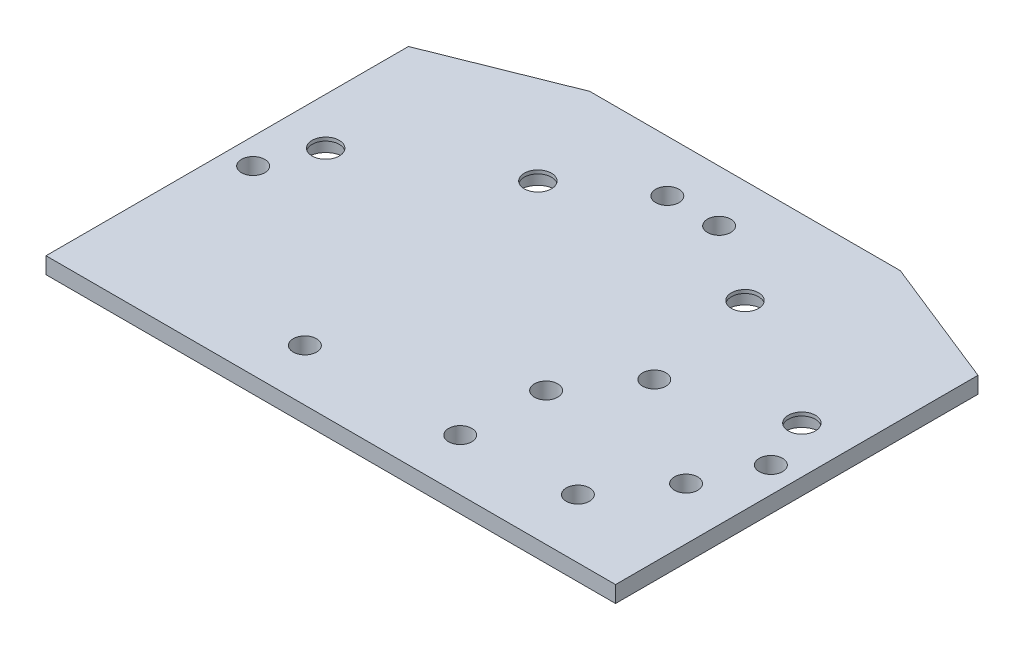
ISO-10303-21;
HEADER;
FILE_DESCRIPTION(('STEP AP214'),'2;1');
FILE_NAME('part.step','',(''),(''),'','','');
FILE_SCHEMA(('AUTOMOTIVE_DESIGN { 1 0 10303 214 1 1 1 1 }'));
ENDSEC;
DATA;
#1=APPLICATION_CONTEXT('core data for automotive mechanical design processes');
#2=APPLICATION_PROTOCOL_DEFINITION('international standard','automotive_design',2000,#1);
#3=PRODUCT_CONTEXT('',#1,'mechanical');
#4=PRODUCT('Part','Part','',(#3));
#5=PRODUCT_RELATED_PRODUCT_CATEGORY('part','',(#4));
#6=PRODUCT_DEFINITION_FORMATION('','',#4);
#7=PRODUCT_DEFINITION_CONTEXT('part definition',#1,'design');
#8=PRODUCT_DEFINITION('design','',#6,#7);
#9=PRODUCT_DEFINITION_SHAPE('','',#8);
#10=(LENGTH_UNIT() NAMED_UNIT(*) SI_UNIT(.MILLI.,.METRE.));
#11=(NAMED_UNIT(*) PLANE_ANGLE_UNIT() SI_UNIT($,.RADIAN.));
#12=(NAMED_UNIT(*) SI_UNIT($,.STERADIAN.) SOLID_ANGLE_UNIT());
#13=UNCERTAINTY_MEASURE_WITH_UNIT(LENGTH_MEASURE(1.E-05),#10,'distance_accuracy_value','');
#14=(GEOMETRIC_REPRESENTATION_CONTEXT(3) GLOBAL_UNCERTAINTY_ASSIGNED_CONTEXT((#13)) GLOBAL_UNIT_ASSIGNED_CONTEXT((#10,
#11,#12)) REPRESENTATION_CONTEXT('',''));
#15=CARTESIAN_POINT('',(0.,0.,0.));
#16=DIRECTION('',(0.,0.,1.));
#17=DIRECTION('',(1.,0.,0.));
#18=AXIS2_PLACEMENT_3D('',#15,#16,#17);
#19=CARTESIAN_POINT('',(-45.9807621135332,1.5875,9.99999999999996));
#20=DIRECTION('',(0.,1.,0.));
#21=DIRECTION('',(0.,0.,1.));
#22=AXIS2_PLACEMENT_3D('',#19,#20,#21);
#23=CYLINDRICAL_SURFACE('',#22,2.625);
#24=CARTESIAN_POINT('',(-45.9807621135332,1.5875,9.99999999999996));
#25=DIRECTION('',(0.,1.,0.));
#26=DIRECTION('',(0.,0.,1.));
#27=AXIS2_PLACEMENT_3D('',#24,#25,#26);
#28=CIRCLE('',#27,2.625);
#29=CARTESIAN_POINT('',(-45.9807621135332,1.5875,12.625));
#30=VERTEX_POINT('',#29);
#31=EDGE_CURVE('E147',#30,#30,#28,.T.);
#32=ORIENTED_EDGE('',*,*,#31,.T.);
#33=EDGE_LOOP('',(#32));
#34=FACE_BOUND('',#33,.T.);
#35=CARTESIAN_POINT('',(-45.9807621135332,0.9125,9.99999999999996));
#36=DIRECTION('',(0.,-1.,0.));
#37=DIRECTION('',(0.,0.,-1.));
#38=AXIS2_PLACEMENT_3D('',#35,#36,#37);
#39=CIRCLE('',#38,2.625);
#40=CARTESIAN_POINT('',(-45.9807621135332,0.9125,7.37499999999996));
#41=VERTEX_POINT('',#40);
#42=EDGE_CURVE('E54',#41,#41,#39,.F.);
#43=ORIENTED_EDGE('',*,*,#42,.F.);
#44=EDGE_LOOP('',(#43));
#45=FACE_BOUND('',#44,.T.);
#46=ADVANCED_FACE('F50',(#34,#45),#23,.F.);
#47=CARTESIAN_POINT('',(-20.,1.5875,-4.99999999999997));
#48=DIRECTION('',(0.,1.,0.));
#49=DIRECTION('',(0.,0.,1.));
#50=AXIS2_PLACEMENT_3D('',#47,#48,#49);
#51=CYLINDRICAL_SURFACE('',#50,2.625);
#52=CARTESIAN_POINT('',(-20.,1.5875,-4.99999999999997));
#53=DIRECTION('',(0.,1.,0.));
#54=DIRECTION('',(0.,0.,1.));
#55=AXIS2_PLACEMENT_3D('',#52,#53,#54);
#56=CIRCLE('',#55,2.625);
#57=CARTESIAN_POINT('',(-20.,1.5875,-2.37499999999997));
#58=VERTEX_POINT('',#57);
#59=EDGE_CURVE('E200',#58,#58,#56,.T.);
#60=ORIENTED_EDGE('',*,*,#59,.T.);
#61=EDGE_LOOP('',(#60));
#62=FACE_BOUND('',#61,.T.);
#63=CARTESIAN_POINT('',(-20.,0.9125,-4.99999999999997));
#64=DIRECTION('',(0.,-1.,0.));
#65=DIRECTION('',(0.,0.,-1.));
#66=AXIS2_PLACEMENT_3D('',#63,#64,#65);
#67=CIRCLE('',#66,2.625);
#68=CARTESIAN_POINT('',(-20.,0.9125,-7.62499999999997));
#69=VERTEX_POINT('',#68);
#70=EDGE_CURVE('E182',#69,#69,#67,.F.);
#71=ORIENTED_EDGE('',*,*,#70,.F.);
#72=EDGE_LOOP('',(#71));
#73=FACE_BOUND('',#72,.T.);
#74=ADVANCED_FACE('F230',(#62,#73),#51,.F.);
#75=CARTESIAN_POINT('',(45.9807621135332,1.5875,9.99999999999996));
#76=DIRECTION('',(0.,1.,0.));
#77=DIRECTION('',(0.,0.,1.));
#78=AXIS2_PLACEMENT_3D('',#75,#76,#77);
#79=CYLINDRICAL_SURFACE('',#78,2.625);
#80=CARTESIAN_POINT('',(45.9807621135332,1.5875,9.99999999999996));
#81=DIRECTION('',(0.,1.,0.));
#82=DIRECTION('',(0.,0.,1.));
#83=AXIS2_PLACEMENT_3D('',#80,#81,#82);
#84=CIRCLE('',#83,2.625);
#85=CARTESIAN_POINT('',(45.9807621135332,1.5875,12.625));
#86=VERTEX_POINT('',#85);
#87=EDGE_CURVE('E194',#86,#86,#84,.T.);
#88=ORIENTED_EDGE('',*,*,#87,.T.);
#89=EDGE_LOOP('',(#88));
#90=FACE_BOUND('',#89,.T.);
#91=CARTESIAN_POINT('',(45.9807621135332,0.9125,9.99999999999996));
#92=DIRECTION('',(0.,-1.,0.));
#93=DIRECTION('',(0.,0.,-1.));
#94=AXIS2_PLACEMENT_3D('',#91,#92,#93);
#95=CIRCLE('',#94,2.625);
#96=CARTESIAN_POINT('',(45.9807621135332,0.9125,7.37499999999996));
#97=VERTEX_POINT('',#96);
#98=EDGE_CURVE('E178',#97,#97,#95,.F.);
#99=ORIENTED_EDGE('',*,*,#98,.F.);
#100=EDGE_LOOP('',(#99));
#101=FACE_BOUND('',#100,.T.);
#102=ADVANCED_FACE('F236',(#90,#101),#79,.F.);
#103=CARTESIAN_POINT('',(20.,1.5875,-4.99999999999997));
#104=DIRECTION('',(0.,1.,0.));
#105=DIRECTION('',(0.,0.,1.));
#106=AXIS2_PLACEMENT_3D('',#103,#104,#105);
#107=CYLINDRICAL_SURFACE('',#106,2.625);
#108=CARTESIAN_POINT('',(20.,1.5875,-4.99999999999997));
#109=DIRECTION('',(0.,1.,0.));
#110=DIRECTION('',(0.,0.,1.));
#111=AXIS2_PLACEMENT_3D('',#108,#109,#110);
#112=CIRCLE('',#111,2.625);
#113=CARTESIAN_POINT('',(20.,1.5875,-2.37499999999997));
#114=VERTEX_POINT('',#113);
#115=EDGE_CURVE('E189',#114,#114,#112,.T.);
#116=ORIENTED_EDGE('',*,*,#115,.T.);
#117=EDGE_LOOP('',(#116));
#118=FACE_BOUND('',#117,.T.);
#119=CARTESIAN_POINT('',(20.,0.9125,-4.99999999999997));
#120=DIRECTION('',(0.,-1.,0.));
#121=DIRECTION('',(0.,0.,-1.));
#122=AXIS2_PLACEMENT_3D('',#119,#120,#121);
#123=CIRCLE('',#122,2.625);
#124=CARTESIAN_POINT('',(20.,0.9125,-7.62499999999997));
#125=VERTEX_POINT('',#124);
#126=EDGE_CURVE('E174',#125,#125,#123,.F.);
#127=ORIENTED_EDGE('',*,*,#126,.F.);
#128=EDGE_LOOP('',(#127));
#129=FACE_BOUND('',#128,.T.);
#130=ADVANCED_FACE('F227',(#118,#129),#107,.F.);
#131=CARTESIAN_POINT('',(-55.,1.5875,55.));
#132=DIRECTION('',(-1.,0.,0.));
#133=DIRECTION('',(0.,0.,1.));
#134=AXIS2_PLACEMENT_3D('',#131,#132,#133);
#135=PLANE('',#134);
#136=DIRECTION('',(0.,0.,-1.));
#137=VECTOR('',#136,1.);
#138=CARTESIAN_POINT('',(-55.,-1.5875,55.));
#139=LINE('',#138,#137);
#140=CARTESIAN_POINT('',(-55.,-1.5875,55.));
#141=VERTEX_POINT('',#140);
#142=CARTESIAN_POINT('',(-55.,-1.5875,-15.));
#143=VERTEX_POINT('',#142);
#144=EDGE_CURVE('E142',#141,#143,#139,.T.);
#145=ORIENTED_EDGE('',*,*,#144,.F.);
#146=DIRECTION('',(0.,-1.,0.));
#147=VECTOR('',#146,1.);
#148=CARTESIAN_POINT('',(-55.,1.5875,55.));
#149=LINE('',#148,#147);
#150=CARTESIAN_POINT('',(-55.,1.5875,55.));
#151=VERTEX_POINT('',#150);
#152=EDGE_CURVE('E11',#151,#141,#149,.T.);
#153=ORIENTED_EDGE('',*,*,#152,.F.);
#154=DIRECTION('',(0.,0.,-1.));
#155=VECTOR('',#154,1.);
#156=CARTESIAN_POINT('',(-55.,1.5875,55.));
#157=LINE('',#156,#155);
#158=CARTESIAN_POINT('',(-55.,1.5875,-15.));
#159=VERTEX_POINT('',#158);
#160=EDGE_CURVE('E163',#151,#159,#157,.T.);
#161=ORIENTED_EDGE('',*,*,#160,.T.);
#162=DIRECTION('',(0.,-1.,0.));
#163=VECTOR('',#162,1.);
#164=CARTESIAN_POINT('',(-55.,1.5875,-15.));
#165=LINE('',#164,#163);
#166=EDGE_CURVE('E102',#159,#143,#165,.T.);
#167=ORIENTED_EDGE('',*,*,#166,.T.);
#168=EDGE_LOOP('',(#145,#153,#161,#167));
#169=FACE_BOUND('',#168,.T.);
#170=ADVANCED_FACE('F52',(#169),#135,.T.);
#171=CARTESIAN_POINT('',(55.,1.5875,55.));
#172=DIRECTION('',(0.,0.,1.));
#173=DIRECTION('',(1.,0.,0.));
#174=AXIS2_PLACEMENT_3D('',#171,#172,#173);
#175=PLANE('',#174);
#176=DIRECTION('',(-1.,0.,0.));
#177=VECTOR('',#176,1.);
#178=CARTESIAN_POINT('',(55.,-1.5875,55.));
#179=LINE('',#178,#177);
#180=CARTESIAN_POINT('',(55.,-1.5875,55.));
#181=VERTEX_POINT('',#180);
#182=EDGE_CURVE('E160',#181,#141,#179,.T.);
#183=ORIENTED_EDGE('',*,*,#182,.F.);
#184=DIRECTION('',(0.,-1.,0.));
#185=VECTOR('',#184,1.);
#186=CARTESIAN_POINT('',(55.,1.5875,55.));
#187=LINE('',#186,#185);
#188=CARTESIAN_POINT('',(55.,1.5875,55.));
#189=VERTEX_POINT('',#188);
#190=EDGE_CURVE('E61',#189,#181,#187,.T.);
#191=ORIENTED_EDGE('',*,*,#190,.F.);
#192=DIRECTION('',(-1.,0.,0.));
#193=VECTOR('',#192,1.);
#194=CARTESIAN_POINT('',(55.,1.5875,55.));
#195=LINE('',#194,#193);
#196=EDGE_CURVE('E118',#189,#151,#195,.T.);
#197=ORIENTED_EDGE('',*,*,#196,.T.);
#198=ORIENTED_EDGE('',*,*,#152,.T.);
#199=EDGE_LOOP('',(#183,#191,#197,#198));
#200=FACE_BOUND('',#199,.T.);
#201=ADVANCED_FACE('F219',(#200),#175,.T.);
#202=CARTESIAN_POINT('',(55.,1.5875,55.));
#203=DIRECTION('',(-1.,0.,0.));
#204=DIRECTION('',(0.,0.,1.));
#205=AXIS2_PLACEMENT_3D('',#202,#203,#204);
#206=PLANE('',#205);
#207=DIRECTION('',(0.,0.,-1.));
#208=VECTOR('',#207,1.);
#209=CARTESIAN_POINT('',(55.,-1.5875,55.));
#210=LINE('',#209,#208);
#211=CARTESIAN_POINT('',(55.,-1.5875,-15.));
#212=VERTEX_POINT('',#211);
#213=EDGE_CURVE('E123',#181,#212,#210,.T.);
#214=ORIENTED_EDGE('',*,*,#213,.T.);
#215=DIRECTION('',(0.,-1.,0.));
#216=VECTOR('',#215,1.);
#217=CARTESIAN_POINT('',(55.,1.5875,-15.));
#218=LINE('',#217,#216);
#219=CARTESIAN_POINT('',(55.,1.5875,-15.));
#220=VERTEX_POINT('',#219);
#221=EDGE_CURVE('E121',#220,#212,#218,.T.);
#222=ORIENTED_EDGE('',*,*,#221,.F.);
#223=DIRECTION('',(0.,0.,-1.));
#224=VECTOR('',#223,1.);
#225=CARTESIAN_POINT('',(55.,1.5875,55.));
#226=LINE('',#225,#224);
#227=EDGE_CURVE('E113',#189,#220,#226,.T.);
#228=ORIENTED_EDGE('',*,*,#227,.F.);
#229=ORIENTED_EDGE('',*,*,#190,.T.);
#230=EDGE_LOOP('',(#214,#222,#228,#229));
#231=FACE_BOUND('',#230,.T.);
#232=ADVANCED_FACE('F122',(#231),#206,.F.);
#233=CARTESIAN_POINT('',(30.,1.5875,-25.));
#234=DIRECTION('',(0.371390676354104,0.,-0.928476690885259));
#235=DIRECTION('',(-0.928476690885259,0.,-0.371390676354104));
#236=AXIS2_PLACEMENT_3D('',#233,#234,#235);
#237=PLANE('',#236);
#238=DIRECTION('',(0.928476690885259,0.,0.371390676354104));
#239=VECTOR('',#238,1.);
#240=CARTESIAN_POINT('',(30.,-1.5875,-25.));
#241=LINE('',#240,#239);
#242=CARTESIAN_POINT('',(30.,-1.5875,-25.));
#243=VERTEX_POINT('',#242);
#244=EDGE_CURVE('E155',#243,#212,#241,.T.);
#245=ORIENTED_EDGE('',*,*,#244,.F.);
#246=DIRECTION('',(0.,-1.,0.));
#247=VECTOR('',#246,1.);
#248=CARTESIAN_POINT('',(30.,1.5875,-25.));
#249=LINE('',#248,#247);
#250=CARTESIAN_POINT('',(30.,1.5875,-25.));
#251=VERTEX_POINT('',#250);
#252=EDGE_CURVE('E128',#251,#243,#249,.T.);
#253=ORIENTED_EDGE('',*,*,#252,.F.);
#254=DIRECTION('',(0.928476690885259,0.,0.371390676354104));
#255=VECTOR('',#254,1.);
#256=CARTESIAN_POINT('',(30.,1.5875,-25.));
#257=LINE('',#256,#255);
#258=EDGE_CURVE('E117',#251,#220,#257,.T.);
#259=ORIENTED_EDGE('',*,*,#258,.T.);
#260=ORIENTED_EDGE('',*,*,#221,.T.);
#261=EDGE_LOOP('',(#245,#253,#259,#260));
#262=FACE_BOUND('',#261,.T.);
#263=ADVANCED_FACE('F130',(#262),#237,.T.);
#264=CARTESIAN_POINT('',(30.,1.5875,-25.));
#265=DIRECTION('',(0.,0.,1.));
#266=DIRECTION('',(1.,0.,0.));
#267=AXIS2_PLACEMENT_3D('',#264,#265,#266);
#268=PLANE('',#267);
#269=DIRECTION('',(-1.,0.,0.));
#270=VECTOR('',#269,1.);
#271=CARTESIAN_POINT('',(30.,-1.5875,-25.));
#272=LINE('',#271,#270);
#273=CARTESIAN_POINT('',(-30.,-1.5875,-25.));
#274=VERTEX_POINT('',#273);
#275=EDGE_CURVE('E151',#243,#274,#272,.T.);
#276=ORIENTED_EDGE('',*,*,#275,.T.);
#277=DIRECTION('',(0.,-1.,0.));
#278=VECTOR('',#277,1.);
#279=CARTESIAN_POINT('',(-30.,1.5875,-25.));
#280=LINE('',#279,#278);
#281=CARTESIAN_POINT('',(-30.,1.5875,-25.));
#282=VERTEX_POINT('',#281);
#283=EDGE_CURVE('E169',#282,#274,#280,.T.);
#284=ORIENTED_EDGE('',*,*,#283,.F.);
#285=DIRECTION('',(-1.,0.,0.));
#286=VECTOR('',#285,1.);
#287=CARTESIAN_POINT('',(30.,1.5875,-25.));
#288=LINE('',#287,#286);
#289=EDGE_CURVE('E133',#251,#282,#288,.T.);
#290=ORIENTED_EDGE('',*,*,#289,.F.);
#291=ORIENTED_EDGE('',*,*,#252,.T.);
#292=EDGE_LOOP('',(#276,#284,#290,#291));
#293=FACE_BOUND('',#292,.T.);
#294=ADVANCED_FACE('F666',(#293),#268,.F.);
#295=CARTESIAN_POINT('',(-55.,1.5875,-15.));
#296=DIRECTION('',(-0.371390676354103,0.,-0.92847669088526));
#297=DIRECTION('',(-0.92847669088526,0.,0.371390676354103));
#298=AXIS2_PLACEMENT_3D('',#295,#296,#297);
#299=PLANE('',#298);
#300=DIRECTION('',(0.92847669088526,0.,-0.371390676354103));
#301=VECTOR('',#300,1.);
#302=CARTESIAN_POINT('',(-55.,-1.5875,-15.));
#303=LINE('',#302,#301);
#304=EDGE_CURVE('E146',#143,#274,#303,.T.);
#305=ORIENTED_EDGE('',*,*,#304,.F.);
#306=ORIENTED_EDGE('',*,*,#166,.F.);
#307=DIRECTION('',(0.92847669088526,0.,-0.371390676354103));
#308=VECTOR('',#307,1.);
#309=CARTESIAN_POINT('',(-55.,1.5875,-15.));
#310=LINE('',#309,#308);
#311=EDGE_CURVE('E136',#159,#282,#310,.T.);
#312=ORIENTED_EDGE('',*,*,#311,.T.);
#313=ORIENTED_EDGE('',*,*,#283,.T.);
#314=EDGE_LOOP('',(#305,#306,#312,#313));
#315=FACE_BOUND('',#314,.T.);
#316=ADVANCED_FACE('F214',(#315),#299,.T.);
#317=CARTESIAN_POINT('',(0.,1.5875,0.));
#318=DIRECTION('',(0.,1.,0.));
#319=DIRECTION('',(0.,0.,1.));
#320=AXIS2_PLACEMENT_3D('',#317,#318,#319);
#321=PLANE('',#320);
#322=CARTESIAN_POINT('',(50.,1.5875,20.));
#323=DIRECTION('',(0.,1.,0.));
#324=DIRECTION('',(0.,0.,1.));
#325=AXIS2_PLACEMENT_3D('',#322,#323,#324);
#326=CIRCLE('',#325,2.24999999999999);
#327=CARTESIAN_POINT('',(50.,1.5875,22.25));
#328=VERTEX_POINT('',#327);
#329=EDGE_CURVE('E387',#328,#328,#326,.T.);
#330=ORIENTED_EDGE('',*,*,#329,.F.);
#331=EDGE_LOOP('',(#330));
#332=FACE_BOUND('',#331,.T.);
#333=CARTESIAN_POINT('',(-50.,1.5875,20.));
#334=DIRECTION('',(0.,1.,0.));
#335=DIRECTION('',(0.,0.,1.));
#336=AXIS2_PLACEMENT_3D('',#333,#334,#335);
#337=CIRCLE('',#336,2.24999999999999);
#338=CARTESIAN_POINT('',(-50.,1.5875,22.25));
#339=VERTEX_POINT('',#338);
#340=EDGE_CURVE('E381',#339,#339,#337,.T.);
#341=ORIENTED_EDGE('',*,*,#340,.F.);
#342=EDGE_LOOP('',(#341));
#343=FACE_BOUND('',#342,.T.);
#344=CARTESIAN_POINT('',(-15.,1.5875,45.));
#345=DIRECTION('',(0.,1.,0.));
#346=DIRECTION('',(0.,0.,1.));
#347=AXIS2_PLACEMENT_3D('',#344,#345,#346);
#348=CIRCLE('',#347,2.24999999999999);
#349=CARTESIAN_POINT('',(-15.,1.5875,47.25));
#350=VERTEX_POINT('',#349);
#351=EDGE_CURVE('E375',#350,#350,#348,.T.);
#352=ORIENTED_EDGE('',*,*,#351,.F.);
#353=EDGE_LOOP('',(#352));
#354=FACE_BOUND('',#353,.T.);
#355=CARTESIAN_POINT('',(15.,1.5875,45.));
#356=DIRECTION('',(0.,1.,0.));
#357=DIRECTION('',(0.,0.,1.));
#358=AXIS2_PLACEMENT_3D('',#355,#356,#357);
#359=CIRCLE('',#358,2.24999999999999);
#360=CARTESIAN_POINT('',(15.,1.5875,47.25));
#361=VERTEX_POINT('',#360);
#362=EDGE_CURVE('E369',#361,#361,#359,.T.);
#363=ORIENTED_EDGE('',*,*,#362,.F.);
#364=EDGE_LOOP('',(#363));
#365=FACE_BOUND('',#364,.T.);
#366=CARTESIAN_POINT('',(5.,1.5875,-15.));
#367=DIRECTION('',(0.,-1.,0.));
#368=DIRECTION('',(0.,0.,-1.));
#369=AXIS2_PLACEMENT_3D('',#366,#367,#368);
#370=CIRCLE('',#369,2.25);
#371=CARTESIAN_POINT('',(5.,1.5875,-17.25));
#372=VERTEX_POINT('',#371);
#373=EDGE_CURVE('E361',#372,#372,#370,.T.);
#374=ORIENTED_EDGE('',*,*,#373,.T.);
#375=EDGE_LOOP('',(#374));
#376=FACE_BOUND('',#375,.T.);
#377=CARTESIAN_POINT('',(-5.,1.5875,-15.));
#378=DIRECTION('',(0.,-1.,0.));
#379=DIRECTION('',(0.,0.,-1.));
#380=AXIS2_PLACEMENT_3D('',#377,#378,#379);
#381=CIRCLE('',#380,2.25);
#382=CARTESIAN_POINT('',(-5.,1.5875,-17.25));
#383=VERTEX_POINT('',#382);
#384=EDGE_CURVE('E355',#383,#383,#381,.T.);
#385=ORIENTED_EDGE('',*,*,#384,.T.);
#386=EDGE_LOOP('',(#385));
#387=FACE_BOUND('',#386,.T.);
#388=CARTESIAN_POINT('',(24.4402734427934,1.5875,16.9616050490339));
#389=DIRECTION('',(0.,-1.,0.));
#390=DIRECTION('',(0.,0.,-1.));
#391=AXIS2_PLACEMENT_3D('',#388,#389,#390);
#392=CIRCLE('',#391,2.25);
#393=CARTESIAN_POINT('',(24.4402734427934,1.5875,14.7116050490339));
#394=VERTEX_POINT('',#393);
#395=EDGE_CURVE('E349',#394,#394,#392,.T.);
#396=ORIENTED_EDGE('',*,*,#395,.T.);
#397=EDGE_LOOP('',(#396));
#398=FACE_BOUND('',#397,.T.);
#399=CARTESIAN_POINT('',(15.8366268975277,1.5875,29.2488857133688));
#400=DIRECTION('',(0.,-1.,0.));
#401=DIRECTION('',(0.,0.,-1.));
#402=AXIS2_PLACEMENT_3D('',#399,#400,#401);
#403=CIRCLE('',#402,2.25);
#404=CARTESIAN_POINT('',(15.8366268975277,1.5875,26.9988857133688));
#405=VERTEX_POINT('',#404);
#406=EDGE_CURVE('E343',#405,#405,#403,.T.);
#407=ORIENTED_EDGE('',*,*,#406,.T.);
#408=EDGE_LOOP('',(#407));
#409=FACE_BOUND('',#408,.T.);
#410=CARTESIAN_POINT('',(44.9190745500182,1.5875,31.3010159578101));
#411=DIRECTION('',(0.,-1.,0.));
#412=DIRECTION('',(0.,0.,-1.));
#413=AXIS2_PLACEMENT_3D('',#410,#411,#412);
#414=CIRCLE('',#413,2.25);
#415=CARTESIAN_POINT('',(44.9190745500182,1.5875,29.0510159578101));
#416=VERTEX_POINT('',#415);
#417=EDGE_CURVE('E337',#416,#416,#414,.T.);
#418=ORIENTED_EDGE('',*,*,#417,.T.);
#419=EDGE_LOOP('',(#418));
#420=FACE_BOUND('',#419,.T.);
#421=CARTESIAN_POINT('',(36.3154280047525,1.5875,43.5882966221449));
#422=DIRECTION('',(0.,-1.,0.));
#423=DIRECTION('',(0.,0.,-1.));
#424=AXIS2_PLACEMENT_3D('',#421,#422,#423);
#425=CIRCLE('',#424,2.25);
#426=CARTESIAN_POINT('',(36.3154280047525,1.5875,41.3382966221449));
#427=VERTEX_POINT('',#426);
#428=EDGE_CURVE('E317',#427,#427,#425,.T.);
#429=ORIENTED_EDGE('',*,*,#428,.T.);
#430=EDGE_LOOP('',(#429));
#431=FACE_BOUND('',#430,.T.);
#432=ORIENTED_EDGE('',*,*,#115,.F.);
#433=EDGE_LOOP('',(#432));
#434=FACE_BOUND('',#433,.T.);
#435=ORIENTED_EDGE('',*,*,#87,.F.);
#436=EDGE_LOOP('',(#435));
#437=FACE_BOUND('',#436,.T.);
#438=ORIENTED_EDGE('',*,*,#59,.F.);
#439=EDGE_LOOP('',(#438));
#440=FACE_BOUND('',#439,.T.);
#441=ORIENTED_EDGE('',*,*,#31,.F.);
#442=EDGE_LOOP('',(#441));
#443=FACE_BOUND('',#442,.T.);
#444=ORIENTED_EDGE('',*,*,#160,.F.);
#445=ORIENTED_EDGE('',*,*,#196,.F.);
#446=ORIENTED_EDGE('',*,*,#227,.T.);
#447=ORIENTED_EDGE('',*,*,#258,.F.);
#448=ORIENTED_EDGE('',*,*,#289,.T.);
#449=ORIENTED_EDGE('',*,*,#311,.F.);
#450=EDGE_LOOP('',(#444,#445,#446,#447,#448,#449));
#451=FACE_BOUND('',#450,.T.);
#452=ADVANCED_FACE('F115',(#332,#343,#354,#365,#376,#387,#398,#409,#420,#431,#434,#437,#440,
#443,#451),#321,.T.);
#453=CARTESIAN_POINT('',(0.,-1.5875,0.));
#454=DIRECTION('',(0.,1.,0.));
#455=DIRECTION('',(0.,0.,1.));
#456=AXIS2_PLACEMENT_3D('',#453,#454,#455);
#457=PLANE('',#456);
#458=CARTESIAN_POINT('',(50.,-1.5875,20.));
#459=DIRECTION('',(0.,1.,0.));
#460=DIRECTION('',(0.,0.,1.));
#461=AXIS2_PLACEMENT_3D('',#458,#459,#460);
#462=CIRCLE('',#461,2.24999999999999);
#463=CARTESIAN_POINT('',(50.,-1.5875,22.25));
#464=VERTEX_POINT('',#463);
#465=EDGE_CURVE('E257',#464,#464,#462,.T.);
#466=ORIENTED_EDGE('',*,*,#465,.T.);
#467=EDGE_LOOP('',(#466));
#468=FACE_BOUND('',#467,.T.);
#469=CARTESIAN_POINT('',(-50.,-1.5875,20.));
#470=DIRECTION('',(0.,1.,0.));
#471=DIRECTION('',(0.,0.,1.));
#472=AXIS2_PLACEMENT_3D('',#469,#470,#471);
#473=CIRCLE('',#472,2.24999999999999);
#474=CARTESIAN_POINT('',(-50.,-1.5875,22.25));
#475=VERTEX_POINT('',#474);
#476=EDGE_CURVE('E261',#475,#475,#473,.T.);
#477=ORIENTED_EDGE('',*,*,#476,.T.);
#478=EDGE_LOOP('',(#477));
#479=FACE_BOUND('',#478,.T.);
#480=CARTESIAN_POINT('',(-15.,-1.5875,45.));
#481=DIRECTION('',(0.,1.,0.));
#482=DIRECTION('',(0.,0.,1.));
#483=AXIS2_PLACEMENT_3D('',#480,#481,#482);
#484=CIRCLE('',#483,2.24999999999999);
#485=CARTESIAN_POINT('',(-15.,-1.5875,47.25));
#486=VERTEX_POINT('',#485);
#487=EDGE_CURVE('E265',#486,#486,#484,.T.);
#488=ORIENTED_EDGE('',*,*,#487,.T.);
#489=EDGE_LOOP('',(#488));
#490=FACE_BOUND('',#489,.T.);
#491=CARTESIAN_POINT('',(15.,-1.5875,45.));
#492=DIRECTION('',(0.,1.,0.));
#493=DIRECTION('',(0.,0.,1.));
#494=AXIS2_PLACEMENT_3D('',#491,#492,#493);
#495=CIRCLE('',#494,2.24999999999999);
#496=CARTESIAN_POINT('',(15.,-1.5875,47.25));
#497=VERTEX_POINT('',#496);
#498=EDGE_CURVE('E269',#497,#497,#495,.T.);
#499=ORIENTED_EDGE('',*,*,#498,.T.);
#500=EDGE_LOOP('',(#499));
#501=FACE_BOUND('',#500,.T.);
#502=CARTESIAN_POINT('',(5.,-1.5875,-15.));
#503=DIRECTION('',(0.,-1.,0.));
#504=DIRECTION('',(0.,0.,-1.));
#505=AXIS2_PLACEMENT_3D('',#502,#503,#504);
#506=CIRCLE('',#505,2.25);
#507=CARTESIAN_POINT('',(5.,-1.5875,-17.25));
#508=VERTEX_POINT('',#507);
#509=EDGE_CURVE('E273',#508,#508,#506,.T.);
#510=ORIENTED_EDGE('',*,*,#509,.F.);
#511=EDGE_LOOP('',(#510));
#512=FACE_BOUND('',#511,.T.);
#513=CARTESIAN_POINT('',(-5.,-1.5875,-15.));
#514=DIRECTION('',(0.,-1.,0.));
#515=DIRECTION('',(0.,0.,-1.));
#516=AXIS2_PLACEMENT_3D('',#513,#514,#515);
#517=CIRCLE('',#516,2.25);
#518=CARTESIAN_POINT('',(-5.,-1.5875,-17.25));
#519=VERTEX_POINT('',#518);
#520=EDGE_CURVE('E277',#519,#519,#517,.T.);
#521=ORIENTED_EDGE('',*,*,#520,.F.);
#522=EDGE_LOOP('',(#521));
#523=FACE_BOUND('',#522,.T.);
#524=CARTESIAN_POINT('',(24.4402734427934,-1.5875,16.9616050490339));
#525=DIRECTION('',(0.,-1.,0.));
#526=DIRECTION('',(0.,0.,-1.));
#527=AXIS2_PLACEMENT_3D('',#524,#525,#526);
#528=CIRCLE('',#527,2.25);
#529=CARTESIAN_POINT('',(24.4402734427934,-1.5875,14.7116050490339));
#530=VERTEX_POINT('',#529);
#531=EDGE_CURVE('E281',#530,#530,#528,.T.);
#532=ORIENTED_EDGE('',*,*,#531,.F.);
#533=EDGE_LOOP('',(#532));
#534=FACE_BOUND('',#533,.T.);
#535=CARTESIAN_POINT('',(15.8366268975277,-1.5875,29.2488857133688));
#536=DIRECTION('',(0.,-1.,0.));
#537=DIRECTION('',(0.,0.,-1.));
#538=AXIS2_PLACEMENT_3D('',#535,#536,#537);
#539=CIRCLE('',#538,2.25);
#540=CARTESIAN_POINT('',(15.8366268975277,-1.5875,26.9988857133688));
#541=VERTEX_POINT('',#540);
#542=EDGE_CURVE('E285',#541,#541,#539,.T.);
#543=ORIENTED_EDGE('',*,*,#542,.F.);
#544=EDGE_LOOP('',(#543));
#545=FACE_BOUND('',#544,.T.);
#546=CARTESIAN_POINT('',(44.9190745500182,-1.5875,31.3010159578101));
#547=DIRECTION('',(0.,-1.,0.));
#548=DIRECTION('',(0.,0.,-1.));
#549=AXIS2_PLACEMENT_3D('',#546,#547,#548);
#550=CIRCLE('',#549,2.25);
#551=CARTESIAN_POINT('',(44.9190745500182,-1.5875,29.0510159578101));
#552=VERTEX_POINT('',#551);
#553=EDGE_CURVE('E289',#552,#552,#550,.T.);
#554=ORIENTED_EDGE('',*,*,#553,.F.);
#555=EDGE_LOOP('',(#554));
#556=FACE_BOUND('',#555,.T.);
#557=CARTESIAN_POINT('',(36.3154280047525,-1.5875,43.5882966221449));
#558=DIRECTION('',(0.,-1.,0.));
#559=DIRECTION('',(0.,0.,-1.));
#560=AXIS2_PLACEMENT_3D('',#557,#558,#559);
#561=CIRCLE('',#560,2.25);
#562=CARTESIAN_POINT('',(36.3154280047525,-1.5875,41.3382966221449));
#563=VERTEX_POINT('',#562);
#564=EDGE_CURVE('E293',#563,#563,#561,.T.);
#565=ORIENTED_EDGE('',*,*,#564,.F.);
#566=EDGE_LOOP('',(#565));
#567=FACE_BOUND('',#566,.T.);
#568=CARTESIAN_POINT('',(-45.9807621135332,-1.5875,9.99999999999996));
#569=DIRECTION('',(0.,-1.,0.));
#570=DIRECTION('',(0.,0.,-1.));
#571=AXIS2_PLACEMENT_3D('',#568,#569,#570);
#572=CIRCLE('',#571,3.45);
#573=CARTESIAN_POINT('',(-45.9807621135332,-1.5875,6.54999999999996));
#574=VERTEX_POINT('',#573);
#575=EDGE_CURVE('E297',#574,#574,#572,.T.);
#576=ORIENTED_EDGE('',*,*,#575,.F.);
#577=EDGE_LOOP('',(#576));
#578=FACE_BOUND('',#577,.T.);
#579=CARTESIAN_POINT('',(-20.,-1.5875,-4.99999999999997));
#580=DIRECTION('',(0.,-1.,0.));
#581=DIRECTION('',(0.,0.,-1.));
#582=AXIS2_PLACEMENT_3D('',#579,#580,#581);
#583=CIRCLE('',#582,3.45);
#584=CARTESIAN_POINT('',(-20.,-1.5875,-8.44999999999998));
#585=VERTEX_POINT('',#584);
#586=EDGE_CURVE('E301',#585,#585,#583,.T.);
#587=ORIENTED_EDGE('',*,*,#586,.F.);
#588=EDGE_LOOP('',(#587));
#589=FACE_BOUND('',#588,.T.);
#590=CARTESIAN_POINT('',(20.,-1.5875,-4.99999999999997));
#591=DIRECTION('',(0.,-1.,0.));
#592=DIRECTION('',(0.,0.,-1.));
#593=AXIS2_PLACEMENT_3D('',#590,#591,#592);
#594=CIRCLE('',#593,3.45);
#595=CARTESIAN_POINT('',(20.,-1.5875,-8.44999999999997));
#596=VERTEX_POINT('',#595);
#597=EDGE_CURVE('E305',#596,#596,#594,.T.);
#598=ORIENTED_EDGE('',*,*,#597,.F.);
#599=EDGE_LOOP('',(#598));
#600=FACE_BOUND('',#599,.T.);
#601=CARTESIAN_POINT('',(45.9807621135332,-1.5875,9.99999999999996));
#602=DIRECTION('',(0.,-1.,0.));
#603=DIRECTION('',(0.,0.,-1.));
#604=AXIS2_PLACEMENT_3D('',#601,#602,#603);
#605=CIRCLE('',#604,3.45);
#606=CARTESIAN_POINT('',(45.9807621135332,-1.5875,6.54999999999996));
#607=VERTEX_POINT('',#606);
#608=EDGE_CURVE('E308',#607,#607,#605,.T.);
#609=ORIENTED_EDGE('',*,*,#608,.F.);
#610=EDGE_LOOP('',(#609));
#611=FACE_BOUND('',#610,.T.);
#612=ORIENTED_EDGE('',*,*,#144,.T.);
#613=ORIENTED_EDGE('',*,*,#304,.T.);
#614=ORIENTED_EDGE('',*,*,#275,.F.);
#615=ORIENTED_EDGE('',*,*,#244,.T.);
#616=ORIENTED_EDGE('',*,*,#213,.F.);
#617=ORIENTED_EDGE('',*,*,#182,.T.);
#618=EDGE_LOOP('',(#612,#613,#614,#615,#616,#617));
#619=FACE_BOUND('',#618,.T.);
#620=ADVANCED_FACE('F218',(#468,#479,#490,#501,#512,#523,#534,#545,#556,#567,#578,#589,#600,
#611,#619),#457,.F.);
#621=CARTESIAN_POINT('',(20.,0.9125,-4.99999999999997));
#622=DIRECTION('',(0.,-1.,0.));
#623=DIRECTION('',(0.,0.,-1.));
#624=AXIS2_PLACEMENT_3D('',#621,#622,#623);
#625=PLANE('',#624);
#626=CARTESIAN_POINT('',(20.,0.9125,-4.99999999999997));
#627=DIRECTION('',(0.,-1.,0.));
#628=DIRECTION('',(0.,0.,-1.));
#629=AXIS2_PLACEMENT_3D('',#626,#627,#628);
#630=CIRCLE('',#629,3.45);
#631=CARTESIAN_POINT('',(20.,0.9125,-8.44999999999997));
#632=VERTEX_POINT('',#631);
#633=EDGE_CURVE('E311',#632,#632,#630,.T.);
#634=ORIENTED_EDGE('',*,*,#633,.T.);
#635=EDGE_LOOP('',(#634));
#636=FACE_BOUND('',#635,.T.);
#637=ORIENTED_EDGE('',*,*,#126,.T.);
#638=EDGE_LOOP('',(#637));
#639=FACE_BOUND('',#638,.T.);
#640=ADVANCED_FACE('F245',(#636,#639),#625,.T.);
#641=CARTESIAN_POINT('',(20.,0.9125,-4.99999999999997));
#642=DIRECTION('',(0.,-1.,0.));
#643=DIRECTION('',(0.,0.,-1.));
#644=AXIS2_PLACEMENT_3D('',#641,#642,#643);
#645=CYLINDRICAL_SURFACE('',#644,3.45);
#646=ORIENTED_EDGE('',*,*,#633,.F.);
#647=EDGE_LOOP('',(#646));
#648=FACE_BOUND('',#647,.T.);
#649=ORIENTED_EDGE('',*,*,#597,.T.);
#650=EDGE_LOOP('',(#649));
#651=FACE_BOUND('',#650,.T.);
#652=ADVANCED_FACE('F251',(#648,#651),#645,.F.);
#653=CARTESIAN_POINT('',(45.9807621135332,0.9125,9.99999999999996));
#654=DIRECTION('',(0.,-1.,0.));
#655=DIRECTION('',(0.,0.,-1.));
#656=AXIS2_PLACEMENT_3D('',#653,#654,#655);
#657=PLANE('',#656);
#658=CARTESIAN_POINT('',(45.9807621135332,0.9125,9.99999999999996));
#659=DIRECTION('',(0.,-1.,0.));
#660=DIRECTION('',(0.,0.,-1.));
#661=AXIS2_PLACEMENT_3D('',#658,#659,#660);
#662=CIRCLE('',#661,3.45);
#663=CARTESIAN_POINT('',(45.9807621135332,0.9125,6.54999999999996));
#664=VERTEX_POINT('',#663);
#665=EDGE_CURVE('E203',#664,#664,#662,.T.);
#666=ORIENTED_EDGE('',*,*,#665,.T.);
#667=EDGE_LOOP('',(#666));
#668=FACE_BOUND('',#667,.T.);
#669=ORIENTED_EDGE('',*,*,#98,.T.);
#670=EDGE_LOOP('',(#669));
#671=FACE_BOUND('',#670,.T.);
#672=ADVANCED_FACE('F424',(#668,#671),#657,.T.);
#673=CARTESIAN_POINT('',(45.9807621135332,0.9125,9.99999999999996));
#674=DIRECTION('',(0.,-1.,0.));
#675=DIRECTION('',(0.,0.,-1.));
#676=AXIS2_PLACEMENT_3D('',#673,#674,#675);
#677=CYLINDRICAL_SURFACE('',#676,3.45);
#678=ORIENTED_EDGE('',*,*,#665,.F.);
#679=EDGE_LOOP('',(#678));
#680=FACE_BOUND('',#679,.T.);
#681=ORIENTED_EDGE('',*,*,#608,.T.);
#682=EDGE_LOOP('',(#681));
#683=FACE_BOUND('',#682,.T.);
#684=ADVANCED_FACE('F426',(#680,#683),#677,.F.);
#685=CARTESIAN_POINT('',(-20.,0.9125,-4.99999999999997));
#686=DIRECTION('',(0.,-1.,0.));
#687=DIRECTION('',(0.,0.,-1.));
#688=AXIS2_PLACEMENT_3D('',#685,#686,#687);
#689=PLANE('',#688);
#690=CARTESIAN_POINT('',(-20.,0.9125,-4.99999999999997));
#691=DIRECTION('',(0.,-1.,0.));
#692=DIRECTION('',(0.,0.,-1.));
#693=AXIS2_PLACEMENT_3D('',#690,#691,#692);
#694=CIRCLE('',#693,3.45);
#695=CARTESIAN_POINT('',(-20.,0.9125,-8.44999999999998));
#696=VERTEX_POINT('',#695);
#697=EDGE_CURVE('E321',#696,#696,#694,.T.);
#698=ORIENTED_EDGE('',*,*,#697,.T.);
#699=EDGE_LOOP('',(#698));
#700=FACE_BOUND('',#699,.T.);
#701=ORIENTED_EDGE('',*,*,#70,.T.);
#702=EDGE_LOOP('',(#701));
#703=FACE_BOUND('',#702,.T.);
#704=ADVANCED_FACE('F433',(#700,#703),#689,.T.);
#705=CARTESIAN_POINT('',(-20.,0.9125,-4.99999999999997));
#706=DIRECTION('',(0.,-1.,0.));
#707=DIRECTION('',(0.,0.,-1.));
#708=AXIS2_PLACEMENT_3D('',#705,#706,#707);
#709=CYLINDRICAL_SURFACE('',#708,3.45);
#710=ORIENTED_EDGE('',*,*,#697,.F.);
#711=EDGE_LOOP('',(#710));
#712=FACE_BOUND('',#711,.T.);
#713=ORIENTED_EDGE('',*,*,#586,.T.);
#714=EDGE_LOOP('',(#713));
#715=FACE_BOUND('',#714,.T.);
#716=ADVANCED_FACE('F513',(#712,#715),#709,.F.);
#717=CARTESIAN_POINT('',(-45.9807621135332,0.9125,9.99999999999996));
#718=DIRECTION('',(0.,-1.,0.));
#719=DIRECTION('',(0.,0.,-1.));
#720=AXIS2_PLACEMENT_3D('',#717,#718,#719);
#721=PLANE('',#720);
#722=CARTESIAN_POINT('',(-45.9807621135332,0.9125,9.99999999999996));
#723=DIRECTION('',(0.,-1.,0.));
#724=DIRECTION('',(0.,0.,-1.));
#725=AXIS2_PLACEMENT_3D('',#722,#723,#724);
#726=CIRCLE('',#725,3.45);
#727=CARTESIAN_POINT('',(-45.9807621135332,0.9125,6.54999999999996));
#728=VERTEX_POINT('',#727);
#729=EDGE_CURVE('E179',#728,#728,#726,.T.);
#730=ORIENTED_EDGE('',*,*,#729,.T.);
#731=EDGE_LOOP('',(#730));
#732=FACE_BOUND('',#731,.T.);
#733=ORIENTED_EDGE('',*,*,#42,.T.);
#734=EDGE_LOOP('',(#733));
#735=FACE_BOUND('',#734,.T.);
#736=ADVANCED_FACE('F523',(#732,#735),#721,.T.);
#737=CARTESIAN_POINT('',(-45.9807621135332,0.9125,9.99999999999996));
#738=DIRECTION('',(0.,-1.,0.));
#739=DIRECTION('',(0.,0.,-1.));
#740=AXIS2_PLACEMENT_3D('',#737,#738,#739);
#741=CYLINDRICAL_SURFACE('',#740,3.45);
#742=ORIENTED_EDGE('',*,*,#729,.F.);
#743=EDGE_LOOP('',(#742));
#744=FACE_BOUND('',#743,.T.);
#745=ORIENTED_EDGE('',*,*,#575,.T.);
#746=EDGE_LOOP('',(#745));
#747=FACE_BOUND('',#746,.T.);
#748=ADVANCED_FACE('F533',(#744,#747),#741,.F.);
#749=CARTESIAN_POINT('',(36.3154280047525,-1.5875,43.5882966221449));
#750=DIRECTION('',(0.,-1.,0.));
#751=DIRECTION('',(0.,0.,-1.));
#752=AXIS2_PLACEMENT_3D('',#749,#750,#751);
#753=CYLINDRICAL_SURFACE('',#752,2.25);
#754=ORIENTED_EDGE('',*,*,#428,.F.);
#755=EDGE_LOOP('',(#754));
#756=FACE_BOUND('',#755,.T.);
#757=ORIENTED_EDGE('',*,*,#564,.T.);
#758=EDGE_LOOP('',(#757));
#759=FACE_BOUND('',#758,.T.);
#760=ADVANCED_FACE('F543',(#756,#759),#753,.F.);
#761=CARTESIAN_POINT('',(44.9190745500182,-1.5875,31.3010159578101));
#762=DIRECTION('',(0.,-1.,0.));
#763=DIRECTION('',(0.,0.,-1.));
#764=AXIS2_PLACEMENT_3D('',#761,#762,#763);
#765=CYLINDRICAL_SURFACE('',#764,2.25);
#766=ORIENTED_EDGE('',*,*,#417,.F.);
#767=EDGE_LOOP('',(#766));
#768=FACE_BOUND('',#767,.T.);
#769=ORIENTED_EDGE('',*,*,#553,.T.);
#770=EDGE_LOOP('',(#769));
#771=FACE_BOUND('',#770,.T.);
#772=ADVANCED_FACE('F553',(#768,#771),#765,.F.);
#773=CARTESIAN_POINT('',(15.8366268975277,-1.5875,29.2488857133688));
#774=DIRECTION('',(0.,-1.,0.));
#775=DIRECTION('',(0.,0.,-1.));
#776=AXIS2_PLACEMENT_3D('',#773,#774,#775);
#777=CYLINDRICAL_SURFACE('',#776,2.25);
#778=ORIENTED_EDGE('',*,*,#406,.F.);
#779=EDGE_LOOP('',(#778));
#780=FACE_BOUND('',#779,.T.);
#781=ORIENTED_EDGE('',*,*,#542,.T.);
#782=EDGE_LOOP('',(#781));
#783=FACE_BOUND('',#782,.T.);
#784=ADVANCED_FACE('F563',(#780,#783),#777,.F.);
#785=CARTESIAN_POINT('',(24.4402734427934,-1.5875,16.9616050490339));
#786=DIRECTION('',(0.,-1.,0.));
#787=DIRECTION('',(0.,0.,-1.));
#788=AXIS2_PLACEMENT_3D('',#785,#786,#787);
#789=CYLINDRICAL_SURFACE('',#788,2.25);
#790=ORIENTED_EDGE('',*,*,#395,.F.);
#791=EDGE_LOOP('',(#790));
#792=FACE_BOUND('',#791,.T.);
#793=ORIENTED_EDGE('',*,*,#531,.T.);
#794=EDGE_LOOP('',(#793));
#795=FACE_BOUND('',#794,.T.);
#796=ADVANCED_FACE('F573',(#792,#795),#789,.F.);
#797=CARTESIAN_POINT('',(-5.,-1.5875,-15.));
#798=DIRECTION('',(0.,-1.,0.));
#799=DIRECTION('',(0.,0.,-1.));
#800=AXIS2_PLACEMENT_3D('',#797,#798,#799);
#801=CYLINDRICAL_SURFACE('',#800,2.25);
#802=ORIENTED_EDGE('',*,*,#384,.F.);
#803=EDGE_LOOP('',(#802));
#804=FACE_BOUND('',#803,.T.);
#805=ORIENTED_EDGE('',*,*,#520,.T.);
#806=EDGE_LOOP('',(#805));
#807=FACE_BOUND('',#806,.T.);
#808=ADVANCED_FACE('F583',(#804,#807),#801,.F.);
#809=CARTESIAN_POINT('',(5.,-1.5875,-15.));
#810=DIRECTION('',(0.,-1.,0.));
#811=DIRECTION('',(0.,0.,-1.));
#812=AXIS2_PLACEMENT_3D('',#809,#810,#811);
#813=CYLINDRICAL_SURFACE('',#812,2.25);
#814=ORIENTED_EDGE('',*,*,#373,.F.);
#815=EDGE_LOOP('',(#814));
#816=FACE_BOUND('',#815,.T.);
#817=ORIENTED_EDGE('',*,*,#509,.T.);
#818=EDGE_LOOP('',(#817));
#819=FACE_BOUND('',#818,.T.);
#820=ADVANCED_FACE('F593',(#816,#819),#813,.F.);
#821=CARTESIAN_POINT('',(15.,1.5875,45.));
#822=DIRECTION('',(0.,1.,0.));
#823=DIRECTION('',(0.,0.,1.));
#824=AXIS2_PLACEMENT_3D('',#821,#822,#823);
#825=CYLINDRICAL_SURFACE('',#824,2.24999999999999);
#826=ORIENTED_EDGE('',*,*,#498,.F.);
#827=EDGE_LOOP('',(#826));
#828=FACE_BOUND('',#827,.T.);
#829=ORIENTED_EDGE('',*,*,#362,.T.);
#830=EDGE_LOOP('',(#829));
#831=FACE_BOUND('',#830,.T.);
#832=ADVANCED_FACE('F603',(#828,#831),#825,.F.);
#833=CARTESIAN_POINT('',(-15.,1.5875,45.));
#834=DIRECTION('',(0.,1.,0.));
#835=DIRECTION('',(0.,0.,1.));
#836=AXIS2_PLACEMENT_3D('',#833,#834,#835);
#837=CYLINDRICAL_SURFACE('',#836,2.24999999999999);
#838=ORIENTED_EDGE('',*,*,#487,.F.);
#839=EDGE_LOOP('',(#838));
#840=FACE_BOUND('',#839,.T.);
#841=ORIENTED_EDGE('',*,*,#351,.T.);
#842=EDGE_LOOP('',(#841));
#843=FACE_BOUND('',#842,.T.);
#844=ADVANCED_FACE('F613',(#840,#843),#837,.F.);
#845=CARTESIAN_POINT('',(-50.,1.5875,20.));
#846=DIRECTION('',(0.,1.,0.));
#847=DIRECTION('',(0.,0.,1.));
#848=AXIS2_PLACEMENT_3D('',#845,#846,#847);
#849=CYLINDRICAL_SURFACE('',#848,2.24999999999999);
#850=ORIENTED_EDGE('',*,*,#476,.F.);
#851=EDGE_LOOP('',(#850));
#852=FACE_BOUND('',#851,.T.);
#853=ORIENTED_EDGE('',*,*,#340,.T.);
#854=EDGE_LOOP('',(#853));
#855=FACE_BOUND('',#854,.T.);
#856=ADVANCED_FACE('F623',(#852,#855),#849,.F.);
#857=CARTESIAN_POINT('',(50.,1.5875,20.));
#858=DIRECTION('',(0.,1.,0.));
#859=DIRECTION('',(0.,0.,1.));
#860=AXIS2_PLACEMENT_3D('',#857,#858,#859);
#861=CYLINDRICAL_SURFACE('',#860,2.24999999999999);
#862=ORIENTED_EDGE('',*,*,#465,.F.);
#863=EDGE_LOOP('',(#862));
#864=FACE_BOUND('',#863,.T.);
#865=ORIENTED_EDGE('',*,*,#329,.T.);
#866=EDGE_LOOP('',(#865));
#867=FACE_BOUND('',#866,.T.);
#868=ADVANCED_FACE('F392',(#864,#867),#861,.F.);
#869=CLOSED_SHELL('',(#46,#74,#102,#130,#170,#201,#232,#263,#294,#316,#452,#620,#640,#652,#672,
#684,#704,#716,#736,#748,#760,#772,#784,#796,#808,#820,#832,#844,#856,#868));
#870=MANIFOLD_SOLID_BREP('B2',#869);
#871=ADVANCED_BREP_SHAPE_REPRESENTATION('',(#18,#870),#14);
#872=SHAPE_DEFINITION_REPRESENTATION(#9,#871);
ENDSEC;
END-ISO-10303-21;
